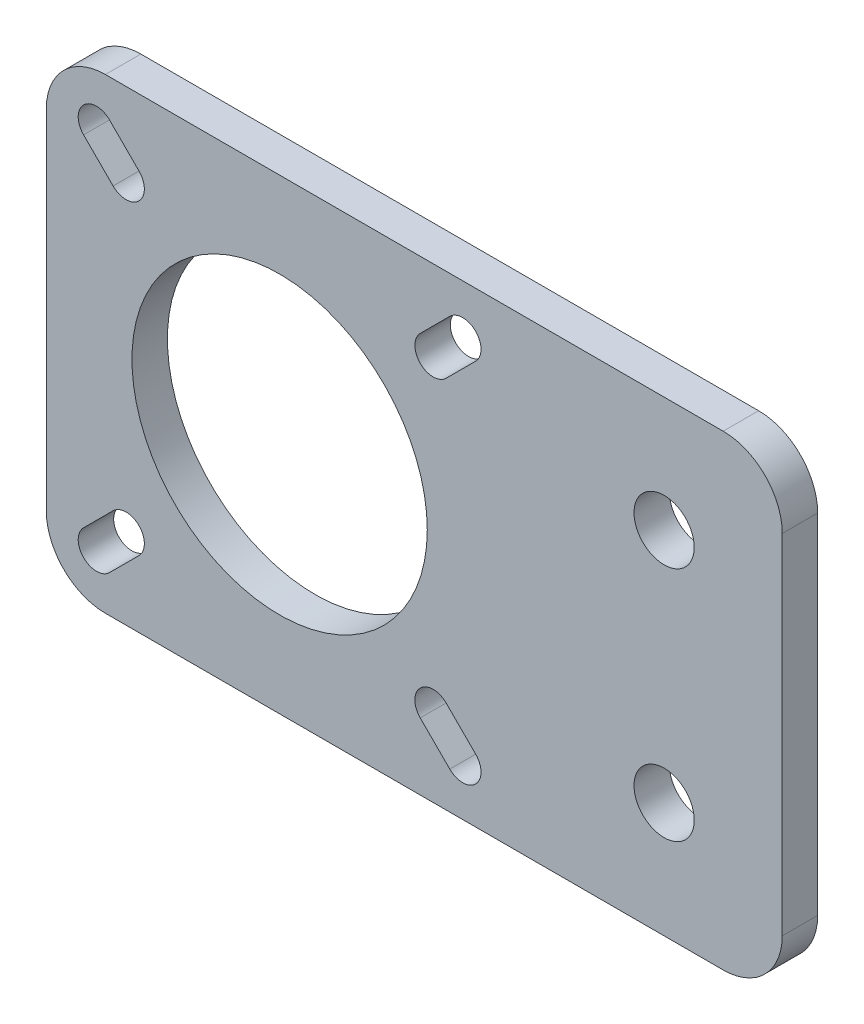
ISO-10303-21;
HEADER;
FILE_DESCRIPTION(('STEP AP214'),'2;1');
FILE_NAME('part.step','',(''),(''),'','','');
FILE_SCHEMA(('AUTOMOTIVE_DESIGN { 1 0 10303 214 1 1 1 1 }'));
ENDSEC;
DATA;
#1=APPLICATION_CONTEXT('core data for automotive mechanical design processes');
#2=APPLICATION_PROTOCOL_DEFINITION('international standard','automotive_design',2000,#1);
#3=PRODUCT_CONTEXT('',#1,'mechanical');
#4=PRODUCT('Part','Part','',(#3));
#5=PRODUCT_RELATED_PRODUCT_CATEGORY('part','',(#4));
#6=PRODUCT_DEFINITION_FORMATION('','',#4);
#7=PRODUCT_DEFINITION_CONTEXT('part definition',#1,'design');
#8=PRODUCT_DEFINITION('design','',#6,#7);
#9=PRODUCT_DEFINITION_SHAPE('','',#8);
#10=(LENGTH_UNIT() NAMED_UNIT(*) SI_UNIT(.MILLI.,.METRE.));
#11=(NAMED_UNIT(*) PLANE_ANGLE_UNIT() SI_UNIT($,.RADIAN.));
#12=(NAMED_UNIT(*) SI_UNIT($,.STERADIAN.) SOLID_ANGLE_UNIT());
#13=UNCERTAINTY_MEASURE_WITH_UNIT(LENGTH_MEASURE(1.E-05),#10,'distance_accuracy_value','');
#14=(GEOMETRIC_REPRESENTATION_CONTEXT(3) GLOBAL_UNCERTAINTY_ASSIGNED_CONTEXT((#13)) GLOBAL_UNIT_ASSIGNED_CONTEXT((#10,
#11,#12)) REPRESENTATION_CONTEXT('',''));
#15=CARTESIAN_POINT('',(0.,0.,0.));
#16=DIRECTION('',(0.,0.,1.));
#17=DIRECTION('',(1.,0.,0.));
#18=AXIS2_PLACEMENT_3D('',#15,#16,#17);
#19=CARTESIAN_POINT('',(0.,0.,3.));
#20=DIRECTION('',(0.,0.,-1.));
#21=DIRECTION('',(-1.,0.,0.));
#22=AXIS2_PLACEMENT_3D('',#19,#20,#21);
#23=PLANE('',#22);
#24=CARTESIAN_POINT('',(35.2499999999996,4.25,3.));
#25=DIRECTION('',(0.,0.,1.));
#26=DIRECTION('',(1.,0.,0.));
#27=AXIS2_PLACEMENT_3D('',#24,#25,#26);
#28=CIRCLE('',#27,1.55);
#29=CARTESIAN_POINT('',(34.1539844891605,3.15398448916086,3.));
#30=VERTEX_POINT('',#29);
#31=CARTESIAN_POINT('',(36.3460155108388,5.34601551083915,3.));
#32=VERTEX_POINT('',#31);
#33=EDGE_CURVE('E240',#30,#32,#28,.T.);
#34=ORIENTED_EDGE('',*,*,#33,.F.);
#35=DIRECTION('',(0.707106781186543,-0.707106781186552,0.));
#36=VECTOR('',#35,1.);
#37=CARTESIAN_POINT('',(34.1539844891605,3.15398448916086,3.));
#38=LINE('',#37,#36);
#39=CARTESIAN_POINT('',(31.6539844891605,5.65398448916084,3.));
#40=VERTEX_POINT('',#39);
#41=EDGE_CURVE('E248',#40,#30,#38,.T.);
#42=ORIENTED_EDGE('',*,*,#41,.F.);
#43=CARTESIAN_POINT('',(32.7499999999997,6.74999999999999,3.));
#44=DIRECTION('',(0.,0.,1.));
#45=DIRECTION('',(1.,0.,0.));
#46=AXIS2_PLACEMENT_3D('',#43,#44,#45);
#47=CIRCLE('',#46,1.55);
#48=CARTESIAN_POINT('',(33.8460155108388,7.84601551083913,3.));
#49=VERTEX_POINT('',#48);
#50=EDGE_CURVE('E245',#49,#40,#47,.T.);
#51=ORIENTED_EDGE('',*,*,#50,.F.);
#52=DIRECTION('',(-0.707106781186543,0.707106781186552,0.));
#53=VECTOR('',#52,1.);
#54=CARTESIAN_POINT('',(36.3460155108388,5.34601551083915,3.));
#55=LINE('',#54,#53);
#56=EDGE_CURVE('E242',#32,#49,#55,.T.);
#57=ORIENTED_EDGE('',*,*,#56,.F.);
#58=EDGE_LOOP('',(#34,#42,#51,#57));
#59=FACE_BOUND('',#58,.T.);
#60=CARTESIAN_POINT('',(4.24999999999997,35.25,3.));
#61=DIRECTION('',(0.,0.,1.));
#62=DIRECTION('',(1.,0.,0.));
#63=AXIS2_PLACEMENT_3D('',#60,#61,#62);
#64=CIRCLE('',#63,1.55);
#65=CARTESIAN_POINT('',(5.34601551083912,36.3460155108391,3.));
#66=VERTEX_POINT('',#65);
#67=CARTESIAN_POINT('',(3.15398448916081,34.1539844891608,3.));
#68=VERTEX_POINT('',#67);
#69=EDGE_CURVE('E302',#66,#68,#64,.T.);
#70=ORIENTED_EDGE('',*,*,#69,.F.);
#71=DIRECTION('',(-0.707106781186544,0.707106781186551,0.));
#72=VECTOR('',#71,1.);
#73=CARTESIAN_POINT('',(5.34601551083912,36.3460155108391,3.));
#74=LINE('',#73,#72);
#75=CARTESIAN_POINT('',(7.84601551083908,33.8460155108392,3.));
#76=VERTEX_POINT('',#75);
#77=EDGE_CURVE('E310',#76,#66,#74,.T.);
#78=ORIENTED_EDGE('',*,*,#77,.F.);
#79=CARTESIAN_POINT('',(6.74999999999993,32.75,3.));
#80=DIRECTION('',(0.,0.,1.));
#81=DIRECTION('',(1.,0.,0.));
#82=AXIS2_PLACEMENT_3D('',#79,#80,#81);
#83=CIRCLE('',#82,1.55);
#84=CARTESIAN_POINT('',(5.65398448916077,31.6539844891609,3.));
#85=VERTEX_POINT('',#84);
#86=EDGE_CURVE('E307',#85,#76,#83,.T.);
#87=ORIENTED_EDGE('',*,*,#86,.F.);
#88=DIRECTION('',(0.707106781186543,-0.707106781186552,0.));
#89=VECTOR('',#88,1.);
#90=CARTESIAN_POINT('',(3.15398448916081,34.1539844891608,3.));
#91=LINE('',#90,#89);
#92=EDGE_CURVE('E304',#68,#85,#91,.T.);
#93=ORIENTED_EDGE('',*,*,#92,.F.);
#94=EDGE_LOOP('',(#70,#78,#87,#93));
#95=FACE_BOUND('',#94,.T.);
#96=DIRECTION('',(0.,-1.,0.));
#97=VECTOR('',#96,1.);
#98=CARTESIAN_POINT('',(0.,0.,3.));
#99=LINE('',#98,#97);
#100=CARTESIAN_POINT('',(0.,34.5,3.));
#101=VERTEX_POINT('',#100);
#102=CARTESIAN_POINT('',(0.,5.,3.));
#103=VERTEX_POINT('',#102);
#104=EDGE_CURVE('E339',#101,#103,#99,.T.);
#105=ORIENTED_EDGE('',*,*,#104,.T.);
#106=CARTESIAN_POINT('',(5.,5.,3.));
#107=DIRECTION('',(0.,0.,-1.));
#108=DIRECTION('',(-1.,0.,0.));
#109=AXIS2_PLACEMENT_3D('',#106,#107,#108);
#110=CIRCLE('',#109,5.);
#111=CARTESIAN_POINT('',(5.,0.,3.));
#112=VERTEX_POINT('',#111);
#113=EDGE_CURVE('E382',#103,#112,#110,.F.);
#114=ORIENTED_EDGE('',*,*,#113,.T.);
#115=DIRECTION('',(1.,0.,0.));
#116=VECTOR('',#115,1.);
#117=CARTESIAN_POINT('',(0.,0.,3.));
#118=LINE('',#117,#116);
#119=CARTESIAN_POINT('',(57.2999999999998,0.,3.));
#120=VERTEX_POINT('',#119);
#121=EDGE_CURVE('E342',#112,#120,#118,.T.);
#122=ORIENTED_EDGE('',*,*,#121,.T.);
#123=CARTESIAN_POINT('',(57.2999999999998,5.,3.));
#124=DIRECTION('',(0.,0.,-1.));
#125=DIRECTION('',(-1.,0.,0.));
#126=AXIS2_PLACEMENT_3D('',#123,#124,#125);
#127=CIRCLE('',#126,5.);
#128=CARTESIAN_POINT('',(62.2999999999998,5.,3.));
#129=VERTEX_POINT('',#128);
#130=EDGE_CURVE('E380',#120,#129,#127,.F.);
#131=ORIENTED_EDGE('',*,*,#130,.T.);
#132=DIRECTION('',(0.,1.,0.));
#133=VECTOR('',#132,1.);
#134=CARTESIAN_POINT('',(62.2999999999998,39.5,3.));
#135=LINE('',#134,#133);
#136=CARTESIAN_POINT('',(62.2999999999998,34.5,3.));
#137=VERTEX_POINT('',#136);
#138=EDGE_CURVE('E346',#129,#137,#135,.T.);
#139=ORIENTED_EDGE('',*,*,#138,.T.);
#140=CARTESIAN_POINT('',(57.2999999999998,34.5,3.));
#141=DIRECTION('',(0.,0.,-1.));
#142=DIRECTION('',(-1.,0.,0.));
#143=AXIS2_PLACEMENT_3D('',#140,#141,#142);
#144=CIRCLE('',#143,5.);
#145=CARTESIAN_POINT('',(57.2999999999998,39.5,3.));
#146=VERTEX_POINT('',#145);
#147=EDGE_CURVE('E54',#137,#146,#144,.F.);
#148=ORIENTED_EDGE('',*,*,#147,.T.);
#149=DIRECTION('',(-1.,0.,0.));
#150=VECTOR('',#149,1.);
#151=CARTESIAN_POINT('',(0.,39.5,3.));
#152=LINE('',#151,#150);
#153=CARTESIAN_POINT('',(5.,39.5,3.));
#154=VERTEX_POINT('',#153);
#155=EDGE_CURVE('E348',#146,#154,#152,.T.);
#156=ORIENTED_EDGE('',*,*,#155,.T.);
#157=CARTESIAN_POINT('',(5.,34.5,3.));
#158=DIRECTION('',(0.,0.,-1.));
#159=DIRECTION('',(-1.,0.,0.));
#160=AXIS2_PLACEMENT_3D('',#157,#158,#159);
#161=CIRCLE('',#160,5.);
#162=EDGE_CURVE('E377',#154,#101,#161,.F.);
#163=ORIENTED_EDGE('',*,*,#162,.T.);
#164=EDGE_LOOP('',(#105,#114,#122,#131,#139,#148,#156,#163));
#165=FACE_BOUND('',#164,.T.);
#166=CARTESIAN_POINT('',(19.7499999999998,19.75,3.));
#167=DIRECTION('',(0.,0.,1.));
#168=DIRECTION('',(1.,0.,0.));
#169=AXIS2_PLACEMENT_3D('',#166,#167,#168);
#170=CIRCLE('',#169,12.5);
#171=CARTESIAN_POINT('',(32.2499999999998,19.75,3.));
#172=VERTEX_POINT('',#171);
#173=EDGE_CURVE('E333',#172,#172,#170,.T.);
#174=ORIENTED_EDGE('',*,*,#173,.F.);
#175=EDGE_LOOP('',(#174));
#176=FACE_BOUND('',#175,.T.);
#177=CARTESIAN_POINT('',(35.2499999999996,35.25,3.));
#178=DIRECTION('',(0.,0.,1.));
#179=DIRECTION('',(-1.,0.,0.));
#180=AXIS2_PLACEMENT_3D('',#177,#178,#179);
#181=CIRCLE('',#180,1.55);
#182=CARTESIAN_POINT('',(36.3460155108388,34.1539844891608,3.));
#183=VERTEX_POINT('',#182);
#184=CARTESIAN_POINT('',(34.1539844891605,36.3460155108391,3.));
#185=VERTEX_POINT('',#184);
#186=EDGE_CURVE('E271',#183,#185,#181,.T.);
#187=ORIENTED_EDGE('',*,*,#186,.F.);
#188=DIRECTION('',(0.707106781186542,0.707106781186553,0.));
#189=VECTOR('',#188,1.);
#190=CARTESIAN_POINT('',(36.3460155108388,34.1539844891608,3.));
#191=LINE('',#190,#189);
#192=CARTESIAN_POINT('',(33.8460155108388,31.6539844891609,3.));
#193=VERTEX_POINT('',#192);
#194=EDGE_CURVE('E279',#193,#183,#191,.T.);
#195=ORIENTED_EDGE('',*,*,#194,.F.);
#196=CARTESIAN_POINT('',(32.7499999999997,32.75,3.));
#197=DIRECTION('',(0.,0.,1.));
#198=DIRECTION('',(-1.,0.,0.));
#199=AXIS2_PLACEMENT_3D('',#196,#197,#198);
#200=CIRCLE('',#199,1.55);
#201=CARTESIAN_POINT('',(31.6539844891605,33.8460155108392,3.));
#202=VERTEX_POINT('',#201);
#203=EDGE_CURVE('E276',#202,#193,#200,.T.);
#204=ORIENTED_EDGE('',*,*,#203,.F.);
#205=DIRECTION('',(-0.707106781186542,-0.707106781186553,0.));
#206=VECTOR('',#205,1.);
#207=CARTESIAN_POINT('',(34.1539844891605,36.3460155108391,3.));
#208=LINE('',#207,#206);
#209=EDGE_CURVE('E273',#185,#202,#208,.T.);
#210=ORIENTED_EDGE('',*,*,#209,.F.);
#211=EDGE_LOOP('',(#187,#195,#204,#210));
#212=FACE_BOUND('',#211,.T.);
#213=CARTESIAN_POINT('',(4.24999999999997,4.25,3.));
#214=DIRECTION('',(0.,0.,1.));
#215=DIRECTION('',(-1.,0.,0.));
#216=AXIS2_PLACEMENT_3D('',#213,#214,#215);
#217=CIRCLE('',#216,1.55);
#218=CARTESIAN_POINT('',(3.15398448916081,5.34601551083915,3.));
#219=VERTEX_POINT('',#218);
#220=CARTESIAN_POINT('',(5.34601551083912,3.15398448916086,3.));
#221=VERTEX_POINT('',#220);
#222=EDGE_CURVE('E196',#219,#221,#217,.T.);
#223=ORIENTED_EDGE('',*,*,#222,.F.);
#224=DIRECTION('',(-0.707106781186543,-0.707106781186552,0.));
#225=VECTOR('',#224,1.);
#226=CARTESIAN_POINT('',(3.15398448916081,5.34601551083915,3.));
#227=LINE('',#226,#225);
#228=CARTESIAN_POINT('',(5.65398448916076,7.84601551083913,3.));
#229=VERTEX_POINT('',#228);
#230=EDGE_CURVE('E222',#229,#219,#227,.T.);
#231=ORIENTED_EDGE('',*,*,#230,.F.);
#232=CARTESIAN_POINT('',(6.74999999999992,6.75,3.));
#233=DIRECTION('',(0.,0.,1.));
#234=DIRECTION('',(-1.,0.,0.));
#235=AXIS2_PLACEMENT_3D('',#232,#233,#234);
#236=CIRCLE('',#235,1.55);
#237=CARTESIAN_POINT('',(7.84601551083908,5.65398448916085,3.));
#238=VERTEX_POINT('',#237);
#239=EDGE_CURVE('E220',#238,#229,#236,.T.);
#240=ORIENTED_EDGE('',*,*,#239,.F.);
#241=DIRECTION('',(0.707106781186544,0.707106781186551,0.));
#242=VECTOR('',#241,1.);
#243=CARTESIAN_POINT('',(5.34601551083912,3.15398448916086,3.));
#244=LINE('',#243,#242);
#245=EDGE_CURVE('E206',#221,#238,#244,.T.);
#246=ORIENTED_EDGE('',*,*,#245,.F.);
#247=EDGE_LOOP('',(#223,#231,#240,#246));
#248=FACE_BOUND('',#247,.T.);
#249=CARTESIAN_POINT('',(52.2999999999998,29.75,3.));
#250=DIRECTION('',(0.,0.,1.));
#251=DIRECTION('',(1.,0.,0.));
#252=AXIS2_PLACEMENT_3D('',#249,#250,#251);
#253=CIRCLE('',#252,2.55);
#254=CARTESIAN_POINT('',(54.8499999999998,29.75,3.));
#255=VERTEX_POINT('',#254);
#256=EDGE_CURVE('E229',#255,#255,#253,.T.);
#257=ORIENTED_EDGE('',*,*,#256,.F.);
#258=EDGE_LOOP('',(#257));
#259=FACE_BOUND('',#258,.T.);
#260=CARTESIAN_POINT('',(52.2999999999998,9.75,3.));
#261=DIRECTION('',(0.,0.,1.));
#262=DIRECTION('',(1.,0.,0.));
#263=AXIS2_PLACEMENT_3D('',#260,#261,#262);
#264=CIRCLE('',#263,2.55);
#265=CARTESIAN_POINT('',(54.8499999999998,9.75,3.));
#266=VERTEX_POINT('',#265);
#267=EDGE_CURVE('E694',#266,#266,#264,.T.);
#268=ORIENTED_EDGE('',*,*,#267,.F.);
#269=EDGE_LOOP('',(#268));
#270=FACE_BOUND('',#269,.T.);
#271=ADVANCED_FACE('F33',(#59,#95,#165,#176,#212,#248,#259,#270),#23,.F.);
#272=CARTESIAN_POINT('',(0.,0.,0.));
#273=DIRECTION('',(0.,0.,-1.));
#274=DIRECTION('',(-1.,0.,0.));
#275=AXIS2_PLACEMENT_3D('',#272,#273,#274);
#276=PLANE('',#275);
#277=CARTESIAN_POINT('',(52.2999999999998,29.75,0.));
#278=DIRECTION('',(0.,0.,1.));
#279=DIRECTION('',(1.,0.,0.));
#280=AXIS2_PLACEMENT_3D('',#277,#278,#279);
#281=CIRCLE('',#280,2.55);
#282=CARTESIAN_POINT('',(54.8499999999998,29.75,0.));
#283=VERTEX_POINT('',#282);
#284=EDGE_CURVE('E700',#283,#283,#281,.T.);
#285=ORIENTED_EDGE('',*,*,#284,.T.);
#286=EDGE_LOOP('',(#285));
#287=FACE_BOUND('',#286,.T.);
#288=DIRECTION('',(1.,0.,0.));
#289=VECTOR('',#288,1.);
#290=CARTESIAN_POINT('',(0.,0.,0.));
#291=LINE('',#290,#289);
#292=CARTESIAN_POINT('',(5.,0.,0.));
#293=VERTEX_POINT('',#292);
#294=CARTESIAN_POINT('',(57.2999999999998,0.,0.));
#295=VERTEX_POINT('',#294);
#296=EDGE_CURVE('E353',#293,#295,#291,.T.);
#297=ORIENTED_EDGE('',*,*,#296,.F.);
#298=CARTESIAN_POINT('',(5.,5.,0.));
#299=DIRECTION('',(0.,0.,-1.));
#300=DIRECTION('',(-1.,0.,0.));
#301=AXIS2_PLACEMENT_3D('',#298,#299,#300);
#302=CIRCLE('',#301,5.);
#303=CARTESIAN_POINT('',(0.,5.,0.));
#304=VERTEX_POINT('',#303);
#305=EDGE_CURVE('E370',#293,#304,#302,.T.);
#306=ORIENTED_EDGE('',*,*,#305,.T.);
#307=DIRECTION('',(0.,-1.,0.));
#308=VECTOR('',#307,1.);
#309=CARTESIAN_POINT('',(0.,0.,0.));
#310=LINE('',#309,#308);
#311=CARTESIAN_POINT('',(0.,34.5,0.));
#312=VERTEX_POINT('',#311);
#313=EDGE_CURVE('E336',#312,#304,#310,.T.);
#314=ORIENTED_EDGE('',*,*,#313,.F.);
#315=CARTESIAN_POINT('',(5.,34.5,0.));
#316=DIRECTION('',(0.,0.,-1.));
#317=DIRECTION('',(-1.,0.,0.));
#318=AXIS2_PLACEMENT_3D('',#315,#316,#317);
#319=CIRCLE('',#318,5.);
#320=CARTESIAN_POINT('',(5.,39.5,0.));
#321=VERTEX_POINT('',#320);
#322=EDGE_CURVE('E364',#312,#321,#319,.T.);
#323=ORIENTED_EDGE('',*,*,#322,.T.);
#324=DIRECTION('',(-1.,0.,0.));
#325=VECTOR('',#324,1.);
#326=CARTESIAN_POINT('',(0.,39.5,0.));
#327=LINE('',#326,#325);
#328=CARTESIAN_POINT('',(57.2999999999998,39.5,0.));
#329=VERTEX_POINT('',#328);
#330=EDGE_CURVE('E343',#329,#321,#327,.T.);
#331=ORIENTED_EDGE('',*,*,#330,.F.);
#332=CARTESIAN_POINT('',(57.2999999999998,34.5,0.));
#333=DIRECTION('',(0.,0.,-1.));
#334=DIRECTION('',(-1.,0.,0.));
#335=AXIS2_PLACEMENT_3D('',#332,#333,#334);
#336=CIRCLE('',#335,5.);
#337=CARTESIAN_POINT('',(62.2999999999998,34.5,0.));
#338=VERTEX_POINT('',#337);
#339=EDGE_CURVE('E366',#329,#338,#336,.T.);
#340=ORIENTED_EDGE('',*,*,#339,.T.);
#341=DIRECTION('',(0.,1.,0.));
#342=VECTOR('',#341,1.);
#343=CARTESIAN_POINT('',(62.2999999999998,39.5,0.));
#344=LINE('',#343,#342);
#345=CARTESIAN_POINT('',(62.2999999999998,5.,0.));
#346=VERTEX_POINT('',#345);
#347=EDGE_CURVE('E356',#346,#338,#344,.T.);
#348=ORIENTED_EDGE('',*,*,#347,.F.);
#349=CARTESIAN_POINT('',(57.2999999999998,5.,0.));
#350=DIRECTION('',(0.,0.,-1.));
#351=DIRECTION('',(-1.,0.,0.));
#352=AXIS2_PLACEMENT_3D('',#349,#350,#351);
#353=CIRCLE('',#352,5.);
#354=EDGE_CURVE('E368',#346,#295,#353,.T.);
#355=ORIENTED_EDGE('',*,*,#354,.T.);
#356=EDGE_LOOP('',(#297,#306,#314,#323,#331,#340,#348,#355));
#357=FACE_BOUND('',#356,.T.);
#358=CARTESIAN_POINT('',(19.7499999999998,19.75,0.));
#359=DIRECTION('',(0.,0.,1.));
#360=DIRECTION('',(1.,0.,0.));
#361=AXIS2_PLACEMENT_3D('',#358,#359,#360);
#362=CIRCLE('',#361,12.5);
#363=CARTESIAN_POINT('',(32.2499999999998,19.75,0.));
#364=VERTEX_POINT('',#363);
#365=EDGE_CURVE('E332',#364,#364,#362,.T.);
#366=ORIENTED_EDGE('',*,*,#365,.T.);
#367=EDGE_LOOP('',(#366));
#368=FACE_BOUND('',#367,.T.);
#369=DIRECTION('',(-0.707106781186544,0.707106781186551,0.));
#370=VECTOR('',#369,1.);
#371=CARTESIAN_POINT('',(5.34601551083912,36.3460155108391,0.));
#372=LINE('',#371,#370);
#373=CARTESIAN_POINT('',(7.84601551083908,33.8460155108392,0.));
#374=VERTEX_POINT('',#373);
#375=CARTESIAN_POINT('',(5.34601551083912,36.3460155108391,0.));
#376=VERTEX_POINT('',#375);
#377=EDGE_CURVE('E305',#374,#376,#372,.T.);
#378=ORIENTED_EDGE('',*,*,#377,.T.);
#379=CARTESIAN_POINT('',(4.24999999999997,35.25,0.));
#380=DIRECTION('',(0.,0.,1.));
#381=DIRECTION('',(1.,0.,0.));
#382=AXIS2_PLACEMENT_3D('',#379,#380,#381);
#383=CIRCLE('',#382,1.55);
#384=CARTESIAN_POINT('',(3.15398448916081,34.1539844891608,0.));
#385=VERTEX_POINT('',#384);
#386=EDGE_CURVE('E301',#376,#385,#383,.T.);
#387=ORIENTED_EDGE('',*,*,#386,.T.);
#388=DIRECTION('',(0.707106781186543,-0.707106781186552,0.));
#389=VECTOR('',#388,1.);
#390=CARTESIAN_POINT('',(3.15398448916081,34.1539844891608,0.));
#391=LINE('',#390,#389);
#392=CARTESIAN_POINT('',(5.65398448916077,31.6539844891609,0.));
#393=VERTEX_POINT('',#392);
#394=EDGE_CURVE('E315',#385,#393,#391,.T.);
#395=ORIENTED_EDGE('',*,*,#394,.T.);
#396=CARTESIAN_POINT('',(6.74999999999993,32.75,0.));
#397=DIRECTION('',(0.,0.,1.));
#398=DIRECTION('',(1.,0.,0.));
#399=AXIS2_PLACEMENT_3D('',#396,#397,#398);
#400=CIRCLE('',#399,1.55);
#401=EDGE_CURVE('E318',#393,#374,#400,.T.);
#402=ORIENTED_EDGE('',*,*,#401,.T.);
#403=EDGE_LOOP('',(#378,#387,#395,#402));
#404=FACE_BOUND('',#403,.T.);
#405=DIRECTION('',(0.707106781186542,0.707106781186553,0.));
#406=VECTOR('',#405,1.);
#407=CARTESIAN_POINT('',(36.3460155108388,34.1539844891608,0.));
#408=LINE('',#407,#406);
#409=CARTESIAN_POINT('',(33.8460155108388,31.6539844891609,0.));
#410=VERTEX_POINT('',#409);
#411=CARTESIAN_POINT('',(36.3460155108388,34.1539844891608,0.));
#412=VERTEX_POINT('',#411);
#413=EDGE_CURVE('E274',#410,#412,#408,.T.);
#414=ORIENTED_EDGE('',*,*,#413,.T.);
#415=CARTESIAN_POINT('',(35.2499999999996,35.25,0.));
#416=DIRECTION('',(0.,0.,1.));
#417=DIRECTION('',(-1.,0.,0.));
#418=AXIS2_PLACEMENT_3D('',#415,#416,#417);
#419=CIRCLE('',#418,1.55);
#420=CARTESIAN_POINT('',(34.1539844891605,36.3460155108391,0.));
#421=VERTEX_POINT('',#420);
#422=EDGE_CURVE('E270',#412,#421,#419,.T.);
#423=ORIENTED_EDGE('',*,*,#422,.T.);
#424=DIRECTION('',(-0.707106781186542,-0.707106781186553,0.));
#425=VECTOR('',#424,1.);
#426=CARTESIAN_POINT('',(34.1539844891605,36.3460155108391,0.));
#427=LINE('',#426,#425);
#428=CARTESIAN_POINT('',(31.6539844891605,33.8460155108392,0.));
#429=VERTEX_POINT('',#428);
#430=EDGE_CURVE('E284',#421,#429,#427,.T.);
#431=ORIENTED_EDGE('',*,*,#430,.T.);
#432=CARTESIAN_POINT('',(32.7499999999997,32.75,0.));
#433=DIRECTION('',(0.,0.,1.));
#434=DIRECTION('',(-1.,0.,0.));
#435=AXIS2_PLACEMENT_3D('',#432,#433,#434);
#436=CIRCLE('',#435,1.55);
#437=EDGE_CURVE('E287',#429,#410,#436,.T.);
#438=ORIENTED_EDGE('',*,*,#437,.T.);
#439=EDGE_LOOP('',(#414,#423,#431,#438));
#440=FACE_BOUND('',#439,.T.);
#441=DIRECTION('',(0.707106781186543,-0.707106781186552,0.));
#442=VECTOR('',#441,1.);
#443=CARTESIAN_POINT('',(34.1539844891605,3.15398448916086,0.));
#444=LINE('',#443,#442);
#445=CARTESIAN_POINT('',(31.6539844891605,5.65398448916084,0.));
#446=VERTEX_POINT('',#445);
#447=CARTESIAN_POINT('',(34.1539844891605,3.15398448916087,0.));
#448=VERTEX_POINT('',#447);
#449=EDGE_CURVE('E243',#446,#448,#444,.T.);
#450=ORIENTED_EDGE('',*,*,#449,.T.);
#451=CARTESIAN_POINT('',(35.2499999999996,4.25,0.));
#452=DIRECTION('',(0.,0.,1.));
#453=DIRECTION('',(1.,0.,0.));
#454=AXIS2_PLACEMENT_3D('',#451,#452,#453);
#455=CIRCLE('',#454,1.55);
#456=CARTESIAN_POINT('',(36.3460155108388,5.34601551083915,0.));
#457=VERTEX_POINT('',#456);
#458=EDGE_CURVE('E214',#448,#457,#455,.T.);
#459=ORIENTED_EDGE('',*,*,#458,.T.);
#460=DIRECTION('',(-0.707106781186543,0.707106781186552,0.));
#461=VECTOR('',#460,1.);
#462=CARTESIAN_POINT('',(36.3460155108388,5.34601551083915,0.));
#463=LINE('',#462,#461);
#464=CARTESIAN_POINT('',(33.8460155108388,7.84601551083913,0.));
#465=VERTEX_POINT('',#464);
#466=EDGE_CURVE('E253',#457,#465,#463,.T.);
#467=ORIENTED_EDGE('',*,*,#466,.T.);
#468=CARTESIAN_POINT('',(32.7499999999997,6.74999999999999,0.));
#469=DIRECTION('',(0.,0.,1.));
#470=DIRECTION('',(1.,0.,0.));
#471=AXIS2_PLACEMENT_3D('',#468,#469,#470);
#472=CIRCLE('',#471,1.55);
#473=EDGE_CURVE('E256',#465,#446,#472,.T.);
#474=ORIENTED_EDGE('',*,*,#473,.T.);
#475=EDGE_LOOP('',(#450,#459,#467,#474));
#476=FACE_BOUND('',#475,.T.);
#477=DIRECTION('',(-0.707106781186543,-0.707106781186552,0.));
#478=VECTOR('',#477,1.);
#479=CARTESIAN_POINT('',(3.15398448916081,5.34601551083915,0.));
#480=LINE('',#479,#478);
#481=CARTESIAN_POINT('',(5.65398448916076,7.84601551083914,0.));
#482=VERTEX_POINT('',#481);
#483=CARTESIAN_POINT('',(3.15398448916081,5.34601551083915,0.));
#484=VERTEX_POINT('',#483);
#485=EDGE_CURVE('E207',#482,#484,#480,.T.);
#486=ORIENTED_EDGE('',*,*,#485,.T.);
#487=CARTESIAN_POINT('',(4.24999999999997,4.25,0.));
#488=DIRECTION('',(0.,0.,1.));
#489=DIRECTION('',(-1.,0.,0.));
#490=AXIS2_PLACEMENT_3D('',#487,#488,#489);
#491=CIRCLE('',#490,1.55);
#492=CARTESIAN_POINT('',(5.34601551083912,3.15398448916086,0.));
#493=VERTEX_POINT('',#492);
#494=EDGE_CURVE('E227',#484,#493,#491,.T.);
#495=ORIENTED_EDGE('',*,*,#494,.T.);
#496=DIRECTION('',(0.707106781186544,0.707106781186551,0.));
#497=VECTOR('',#496,1.);
#498=CARTESIAN_POINT('',(5.34601551083912,3.15398448916086,0.));
#499=LINE('',#498,#497);
#500=CARTESIAN_POINT('',(7.84601551083908,5.65398448916085,0.));
#501=VERTEX_POINT('',#500);
#502=EDGE_CURVE('E213',#493,#501,#499,.T.);
#503=ORIENTED_EDGE('',*,*,#502,.T.);
#504=CARTESIAN_POINT('',(6.74999999999992,6.75,0.));
#505=DIRECTION('',(0.,0.,1.));
#506=DIRECTION('',(-1.,0.,0.));
#507=AXIS2_PLACEMENT_3D('',#504,#505,#506);
#508=CIRCLE('',#507,1.55);
#509=EDGE_CURVE('E231',#501,#482,#508,.T.);
#510=ORIENTED_EDGE('',*,*,#509,.T.);
#511=EDGE_LOOP('',(#486,#495,#503,#510));
#512=FACE_BOUND('',#511,.T.);
#513=CARTESIAN_POINT('',(52.2999999999998,9.75,0.));
#514=DIRECTION('',(0.,0.,1.));
#515=DIRECTION('',(1.,0.,0.));
#516=AXIS2_PLACEMENT_3D('',#513,#514,#515);
#517=CIRCLE('',#516,2.55);
#518=CARTESIAN_POINT('',(54.8499999999998,9.75,0.));
#519=VERTEX_POINT('',#518);
#520=EDGE_CURVE('E697',#519,#519,#517,.T.);
#521=ORIENTED_EDGE('',*,*,#520,.T.);
#522=EDGE_LOOP('',(#521));
#523=FACE_BOUND('',#522,.T.);
#524=ADVANCED_FACE('F398',(#287,#357,#368,#404,#440,#476,#512,#523),#276,.T.);
#525=CARTESIAN_POINT('',(0.,0.,3.));
#526=DIRECTION('',(1.,0.,0.));
#527=DIRECTION('',(0.,0.,-1.));
#528=AXIS2_PLACEMENT_3D('',#525,#526,#527);
#529=PLANE('',#528);
#530=ORIENTED_EDGE('',*,*,#313,.T.);
#531=DIRECTION('',(0.,0.,-1.));
#532=VECTOR('',#531,1.);
#533=CARTESIAN_POINT('',(0.,5.,3.));
#534=LINE('',#533,#532);
#535=EDGE_CURVE('E375',#304,#103,#534,.F.);
#536=ORIENTED_EDGE('',*,*,#535,.T.);
#537=ORIENTED_EDGE('',*,*,#104,.F.);
#538=DIRECTION('',(0.,0.,-1.));
#539=VECTOR('',#538,1.);
#540=CARTESIAN_POINT('',(0.,34.5,3.));
#541=LINE('',#540,#539);
#542=EDGE_CURVE('E372',#101,#312,#541,.T.);
#543=ORIENTED_EDGE('',*,*,#542,.T.);
#544=EDGE_LOOP('',(#530,#536,#537,#543));
#545=FACE_BOUND('',#544,.T.);
#546=ADVANCED_FACE('F412',(#545),#529,.F.);
#547=CARTESIAN_POINT('',(0.,0.,3.));
#548=DIRECTION('',(0.,1.,0.));
#549=DIRECTION('',(0.,0.,1.));
#550=AXIS2_PLACEMENT_3D('',#547,#548,#549);
#551=PLANE('',#550);
#552=ORIENTED_EDGE('',*,*,#121,.F.);
#553=DIRECTION('',(0.,0.,-1.));
#554=VECTOR('',#553,1.);
#555=CARTESIAN_POINT('',(5.,0.,3.));
#556=LINE('',#555,#554);
#557=EDGE_CURVE('E361',#112,#293,#556,.T.);
#558=ORIENTED_EDGE('',*,*,#557,.T.);
#559=ORIENTED_EDGE('',*,*,#296,.T.);
#560=DIRECTION('',(0.,0.,-1.));
#561=VECTOR('',#560,1.);
#562=CARTESIAN_POINT('',(57.2999999999998,0.,3.));
#563=LINE('',#562,#561);
#564=EDGE_CURVE('E350',#295,#120,#563,.F.);
#565=ORIENTED_EDGE('',*,*,#564,.T.);
#566=EDGE_LOOP('',(#552,#558,#559,#565));
#567=FACE_BOUND('',#566,.T.);
#568=ADVANCED_FACE('F420',(#567),#551,.F.);
#569=CARTESIAN_POINT('',(62.2999999999998,39.5,3.));
#570=DIRECTION('',(-1.,0.,0.));
#571=DIRECTION('',(0.,0.,1.));
#572=AXIS2_PLACEMENT_3D('',#569,#570,#571);
#573=PLANE('',#572);
#574=ORIENTED_EDGE('',*,*,#138,.F.);
#575=DIRECTION('',(0.,0.,-1.));
#576=VECTOR('',#575,1.);
#577=CARTESIAN_POINT('',(62.2999999999998,5.,3.));
#578=LINE('',#577,#576);
#579=EDGE_CURVE('E386',#129,#346,#578,.T.);
#580=ORIENTED_EDGE('',*,*,#579,.T.);
#581=ORIENTED_EDGE('',*,*,#347,.T.);
#582=DIRECTION('',(0.,0.,-1.));
#583=VECTOR('',#582,1.);
#584=CARTESIAN_POINT('',(62.2999999999998,34.5,3.));
#585=LINE('',#584,#583);
#586=EDGE_CURVE('E384',#338,#137,#585,.F.);
#587=ORIENTED_EDGE('',*,*,#586,.T.);
#588=EDGE_LOOP('',(#574,#580,#581,#587));
#589=FACE_BOUND('',#588,.T.);
#590=ADVANCED_FACE('F392',(#589),#573,.F.);
#591=CARTESIAN_POINT('',(0.,39.5,3.));
#592=DIRECTION('',(0.,-1.,0.));
#593=DIRECTION('',(0.,0.,-1.));
#594=AXIS2_PLACEMENT_3D('',#591,#592,#593);
#595=PLANE('',#594);
#596=ORIENTED_EDGE('',*,*,#155,.F.);
#597=DIRECTION('',(0.,0.,-1.));
#598=VECTOR('',#597,1.);
#599=CARTESIAN_POINT('',(57.2999999999998,39.5,3.));
#600=LINE('',#599,#598);
#601=EDGE_CURVE('E11',#146,#329,#600,.T.);
#602=ORIENTED_EDGE('',*,*,#601,.T.);
#603=ORIENTED_EDGE('',*,*,#330,.T.);
#604=DIRECTION('',(0.,0.,-1.));
#605=VECTOR('',#604,1.);
#606=CARTESIAN_POINT('',(5.,39.5,3.));
#607=LINE('',#606,#605);
#608=EDGE_CURVE('E41',#321,#154,#607,.F.);
#609=ORIENTED_EDGE('',*,*,#608,.T.);
#610=EDGE_LOOP('',(#596,#602,#603,#609));
#611=FACE_BOUND('',#610,.T.);
#612=ADVANCED_FACE('F404',(#611),#595,.F.);
#613=CARTESIAN_POINT('',(19.7499999999998,19.75,3.));
#614=DIRECTION('',(0.,0.,-1.));
#615=DIRECTION('',(-1.,0.,0.));
#616=AXIS2_PLACEMENT_3D('',#613,#614,#615);
#617=CYLINDRICAL_SURFACE('',#616,12.5);
#618=ORIENTED_EDGE('',*,*,#173,.T.);
#619=EDGE_LOOP('',(#618));
#620=FACE_BOUND('',#619,.T.);
#621=ORIENTED_EDGE('',*,*,#365,.F.);
#622=EDGE_LOOP('',(#621));
#623=FACE_BOUND('',#622,.T.);
#624=ADVANCED_FACE('F442',(#620,#623),#617,.F.);
#625=CARTESIAN_POINT('',(4.24999999999997,35.25,3.));
#626=DIRECTION('',(0.,0.,-1.));
#627=DIRECTION('',(-1.,0.,0.));
#628=AXIS2_PLACEMENT_3D('',#625,#626,#627);
#629=CYLINDRICAL_SURFACE('',#628,1.55);
#630=ORIENTED_EDGE('',*,*,#386,.F.);
#631=DIRECTION('',(0.,0.,-1.));
#632=VECTOR('',#631,1.);
#633=CARTESIAN_POINT('',(5.34601551083912,36.3460155108391,3.));
#634=LINE('',#633,#632);
#635=EDGE_CURVE('E312',#66,#376,#634,.T.);
#636=ORIENTED_EDGE('',*,*,#635,.F.);
#637=ORIENTED_EDGE('',*,*,#69,.T.);
#638=DIRECTION('',(0.,0.,-1.));
#639=VECTOR('',#638,1.);
#640=CARTESIAN_POINT('',(3.15398448916081,34.1539844891608,3.));
#641=LINE('',#640,#639);
#642=EDGE_CURVE('E329',#68,#385,#641,.T.);
#643=ORIENTED_EDGE('',*,*,#642,.T.);
#644=EDGE_LOOP('',(#630,#636,#637,#643));
#645=FACE_BOUND('',#644,.T.);
#646=ADVANCED_FACE('F475',(#645),#629,.F.);
#647=CARTESIAN_POINT('',(3.15398448916081,34.1539844891608,3.));
#648=DIRECTION('',(0.707106781186552,0.707106781186543,0.));
#649=DIRECTION('',(-0.707106781186543,0.707106781186552,0.));
#650=AXIS2_PLACEMENT_3D('',#647,#648,#649);
#651=PLANE('',#650);
#652=ORIENTED_EDGE('',*,*,#394,.F.);
#653=ORIENTED_EDGE('',*,*,#642,.F.);
#654=ORIENTED_EDGE('',*,*,#92,.T.);
#655=DIRECTION('',(0.,0.,-1.));
#656=VECTOR('',#655,1.);
#657=CARTESIAN_POINT('',(5.65398448916077,31.6539844891609,3.));
#658=LINE('',#657,#656);
#659=EDGE_CURVE('E327',#85,#393,#658,.T.);
#660=ORIENTED_EDGE('',*,*,#659,.T.);
#661=EDGE_LOOP('',(#652,#653,#654,#660));
#662=FACE_BOUND('',#661,.T.);
#663=ADVANCED_FACE('F482',(#662),#651,.T.);
#664=CARTESIAN_POINT('',(6.74999999999993,32.75,3.));
#665=DIRECTION('',(0.,0.,-1.));
#666=DIRECTION('',(-1.,0.,0.));
#667=AXIS2_PLACEMENT_3D('',#664,#665,#666);
#668=CYLINDRICAL_SURFACE('',#667,1.55);
#669=ORIENTED_EDGE('',*,*,#401,.F.);
#670=ORIENTED_EDGE('',*,*,#659,.F.);
#671=ORIENTED_EDGE('',*,*,#86,.T.);
#672=DIRECTION('',(0.,0.,-1.));
#673=VECTOR('',#672,1.);
#674=CARTESIAN_POINT('',(7.84601551083908,33.8460155108392,3.));
#675=LINE('',#674,#673);
#676=EDGE_CURVE('E325',#76,#374,#675,.T.);
#677=ORIENTED_EDGE('',*,*,#676,.T.);
#678=EDGE_LOOP('',(#669,#670,#671,#677));
#679=FACE_BOUND('',#678,.T.);
#680=ADVANCED_FACE('F489',(#679),#668,.F.);
#681=CARTESIAN_POINT('',(5.34601551083912,36.3460155108391,3.));
#682=DIRECTION('',(-0.707106781186551,-0.707106781186544,0.));
#683=DIRECTION('',(0.707106781186544,-0.707106781186551,0.));
#684=AXIS2_PLACEMENT_3D('',#681,#682,#683);
#685=PLANE('',#684);
#686=ORIENTED_EDGE('',*,*,#377,.F.);
#687=ORIENTED_EDGE('',*,*,#676,.F.);
#688=ORIENTED_EDGE('',*,*,#77,.T.);
#689=ORIENTED_EDGE('',*,*,#635,.T.);
#690=EDGE_LOOP('',(#686,#687,#688,#689));
#691=FACE_BOUND('',#690,.T.);
#692=ADVANCED_FACE('F497',(#691),#685,.T.);
#693=CARTESIAN_POINT('',(35.2499999999996,35.25,3.));
#694=DIRECTION('',(0.,0.,-1.));
#695=DIRECTION('',(-1.,0.,0.));
#696=AXIS2_PLACEMENT_3D('',#693,#694,#695);
#697=CYLINDRICAL_SURFACE('',#696,1.55);
#698=ORIENTED_EDGE('',*,*,#422,.F.);
#699=DIRECTION('',(0.,0.,-1.));
#700=VECTOR('',#699,1.);
#701=CARTESIAN_POINT('',(36.3460155108388,34.1539844891608,3.));
#702=LINE('',#701,#700);
#703=EDGE_CURVE('E281',#183,#412,#702,.T.);
#704=ORIENTED_EDGE('',*,*,#703,.F.);
#705=ORIENTED_EDGE('',*,*,#186,.T.);
#706=DIRECTION('',(0.,0.,-1.));
#707=VECTOR('',#706,1.);
#708=CARTESIAN_POINT('',(34.1539844891605,36.3460155108391,3.));
#709=LINE('',#708,#707);
#710=EDGE_CURVE('E298',#185,#421,#709,.T.);
#711=ORIENTED_EDGE('',*,*,#710,.T.);
#712=EDGE_LOOP('',(#698,#704,#705,#711));
#713=FACE_BOUND('',#712,.T.);
#714=ADVANCED_FACE('F505',(#713),#697,.F.);
#715=CARTESIAN_POINT('',(34.1539844891605,36.3460155108391,3.));
#716=DIRECTION('',(0.707106781186553,-0.707106781186542,0.));
#717=DIRECTION('',(0.707106781186542,0.707106781186553,0.));
#718=AXIS2_PLACEMENT_3D('',#715,#716,#717);
#719=PLANE('',#718);
#720=ORIENTED_EDGE('',*,*,#430,.F.);
#721=ORIENTED_EDGE('',*,*,#710,.F.);
#722=ORIENTED_EDGE('',*,*,#209,.T.);
#723=DIRECTION('',(0.,0.,-1.));
#724=VECTOR('',#723,1.);
#725=CARTESIAN_POINT('',(31.6539844891605,33.8460155108392,3.));
#726=LINE('',#725,#724);
#727=EDGE_CURVE('E296',#202,#429,#726,.T.);
#728=ORIENTED_EDGE('',*,*,#727,.T.);
#729=EDGE_LOOP('',(#720,#721,#722,#728));
#730=FACE_BOUND('',#729,.T.);
#731=ADVANCED_FACE('F513',(#730),#719,.T.);
#732=CARTESIAN_POINT('',(32.7499999999997,32.75,3.));
#733=DIRECTION('',(0.,0.,-1.));
#734=DIRECTION('',(-1.,0.,0.));
#735=AXIS2_PLACEMENT_3D('',#732,#733,#734);
#736=CYLINDRICAL_SURFACE('',#735,1.55);
#737=ORIENTED_EDGE('',*,*,#437,.F.);
#738=ORIENTED_EDGE('',*,*,#727,.F.);
#739=ORIENTED_EDGE('',*,*,#203,.T.);
#740=DIRECTION('',(0.,0.,-1.));
#741=VECTOR('',#740,1.);
#742=CARTESIAN_POINT('',(33.8460155108388,31.6539844891609,3.));
#743=LINE('',#742,#741);
#744=EDGE_CURVE('E294',#193,#410,#743,.T.);
#745=ORIENTED_EDGE('',*,*,#744,.T.);
#746=EDGE_LOOP('',(#737,#738,#739,#745));
#747=FACE_BOUND('',#746,.T.);
#748=ADVANCED_FACE('F521',(#747),#736,.F.);
#749=CARTESIAN_POINT('',(36.3460155108388,34.1539844891608,3.));
#750=DIRECTION('',(-0.707106781186553,0.707106781186542,0.));
#751=DIRECTION('',(-0.707106781186542,-0.707106781186553,0.));
#752=AXIS2_PLACEMENT_3D('',#749,#750,#751);
#753=PLANE('',#752);
#754=ORIENTED_EDGE('',*,*,#413,.F.);
#755=ORIENTED_EDGE('',*,*,#744,.F.);
#756=ORIENTED_EDGE('',*,*,#194,.T.);
#757=ORIENTED_EDGE('',*,*,#703,.T.);
#758=EDGE_LOOP('',(#754,#755,#756,#757));
#759=FACE_BOUND('',#758,.T.);
#760=ADVANCED_FACE('F529',(#759),#753,.T.);
#761=CARTESIAN_POINT('',(35.2499999999996,4.25,3.));
#762=DIRECTION('',(0.,0.,-1.));
#763=DIRECTION('',(-1.,0.,0.));
#764=AXIS2_PLACEMENT_3D('',#761,#762,#763);
#765=CYLINDRICAL_SURFACE('',#764,1.55);
#766=ORIENTED_EDGE('',*,*,#458,.F.);
#767=DIRECTION('',(0.,0.,-1.));
#768=VECTOR('',#767,1.);
#769=CARTESIAN_POINT('',(34.1539844891605,3.15398448916086,3.));
#770=LINE('',#769,#768);
#771=EDGE_CURVE('E250',#30,#448,#770,.T.);
#772=ORIENTED_EDGE('',*,*,#771,.F.);
#773=ORIENTED_EDGE('',*,*,#33,.T.);
#774=DIRECTION('',(0.,0.,-1.));
#775=VECTOR('',#774,1.);
#776=CARTESIAN_POINT('',(36.3460155108388,5.34601551083915,3.));
#777=LINE('',#776,#775);
#778=EDGE_CURVE('E267',#32,#457,#777,.T.);
#779=ORIENTED_EDGE('',*,*,#778,.T.);
#780=EDGE_LOOP('',(#766,#772,#773,#779));
#781=FACE_BOUND('',#780,.T.);
#782=ADVANCED_FACE('F537',(#781),#765,.F.);
#783=CARTESIAN_POINT('',(36.3460155108388,5.34601551083915,3.));
#784=DIRECTION('',(-0.707106781186552,-0.707106781186543,0.));
#785=DIRECTION('',(0.707106781186543,-0.707106781186552,0.));
#786=AXIS2_PLACEMENT_3D('',#783,#784,#785);
#787=PLANE('',#786);
#788=ORIENTED_EDGE('',*,*,#466,.F.);
#789=ORIENTED_EDGE('',*,*,#778,.F.);
#790=ORIENTED_EDGE('',*,*,#56,.T.);
#791=DIRECTION('',(0.,0.,-1.));
#792=VECTOR('',#791,1.);
#793=CARTESIAN_POINT('',(33.8460155108388,7.84601551083913,3.));
#794=LINE('',#793,#792);
#795=EDGE_CURVE('E265',#49,#465,#794,.T.);
#796=ORIENTED_EDGE('',*,*,#795,.T.);
#797=EDGE_LOOP('',(#788,#789,#790,#796));
#798=FACE_BOUND('',#797,.T.);
#799=ADVANCED_FACE('F545',(#798),#787,.T.);
#800=CARTESIAN_POINT('',(32.7499999999997,6.74999999999999,3.));
#801=DIRECTION('',(0.,0.,-1.));
#802=DIRECTION('',(-1.,0.,0.));
#803=AXIS2_PLACEMENT_3D('',#800,#801,#802);
#804=CYLINDRICAL_SURFACE('',#803,1.55);
#805=ORIENTED_EDGE('',*,*,#473,.F.);
#806=ORIENTED_EDGE('',*,*,#795,.F.);
#807=ORIENTED_EDGE('',*,*,#50,.T.);
#808=DIRECTION('',(0.,0.,-1.));
#809=VECTOR('',#808,1.);
#810=CARTESIAN_POINT('',(31.6539844891605,5.65398448916084,3.));
#811=LINE('',#810,#809);
#812=EDGE_CURVE('E263',#40,#446,#811,.T.);
#813=ORIENTED_EDGE('',*,*,#812,.T.);
#814=EDGE_LOOP('',(#805,#806,#807,#813));
#815=FACE_BOUND('',#814,.T.);
#816=ADVANCED_FACE('F553',(#815),#804,.F.);
#817=CARTESIAN_POINT('',(34.1539844891605,3.15398448916086,3.));
#818=DIRECTION('',(0.707106781186552,0.707106781186543,0.));
#819=DIRECTION('',(-0.707106781186543,0.707106781186552,0.));
#820=AXIS2_PLACEMENT_3D('',#817,#818,#819);
#821=PLANE('',#820);
#822=ORIENTED_EDGE('',*,*,#449,.F.);
#823=ORIENTED_EDGE('',*,*,#812,.F.);
#824=ORIENTED_EDGE('',*,*,#41,.T.);
#825=ORIENTED_EDGE('',*,*,#771,.T.);
#826=EDGE_LOOP('',(#822,#823,#824,#825));
#827=FACE_BOUND('',#826,.T.);
#828=ADVANCED_FACE('F561',(#827),#821,.T.);
#829=CARTESIAN_POINT('',(4.24999999999997,4.25,3.));
#830=DIRECTION('',(0.,0.,-1.));
#831=DIRECTION('',(-1.,0.,0.));
#832=AXIS2_PLACEMENT_3D('',#829,#830,#831);
#833=CYLINDRICAL_SURFACE('',#832,1.55);
#834=ORIENTED_EDGE('',*,*,#494,.F.);
#835=DIRECTION('',(0.,0.,-1.));
#836=VECTOR('',#835,1.);
#837=CARTESIAN_POINT('',(3.15398448916081,5.34601551083915,3.));
#838=LINE('',#837,#836);
#839=EDGE_CURVE('E202',#219,#484,#838,.T.);
#840=ORIENTED_EDGE('',*,*,#839,.F.);
#841=ORIENTED_EDGE('',*,*,#222,.T.);
#842=DIRECTION('',(0.,0.,-1.));
#843=VECTOR('',#842,1.);
#844=CARTESIAN_POINT('',(5.34601551083912,3.15398448916086,3.));
#845=LINE('',#844,#843);
#846=EDGE_CURVE('E199',#221,#493,#845,.T.);
#847=ORIENTED_EDGE('',*,*,#846,.T.);
#848=EDGE_LOOP('',(#834,#840,#841,#847));
#849=FACE_BOUND('',#848,.T.);
#850=ADVANCED_FACE('F198',(#849),#833,.F.);
#851=CARTESIAN_POINT('',(5.34601551083912,3.15398448916086,3.));
#852=DIRECTION('',(-0.707106781186551,0.707106781186544,0.));
#853=DIRECTION('',(-0.707106781186544,-0.707106781186551,0.));
#854=AXIS2_PLACEMENT_3D('',#851,#852,#853);
#855=PLANE('',#854);
#856=ORIENTED_EDGE('',*,*,#502,.F.);
#857=ORIENTED_EDGE('',*,*,#846,.F.);
#858=ORIENTED_EDGE('',*,*,#245,.T.);
#859=DIRECTION('',(0.,0.,-1.));
#860=VECTOR('',#859,1.);
#861=CARTESIAN_POINT('',(7.84601551083908,5.65398448916085,3.));
#862=LINE('',#861,#860);
#863=EDGE_CURVE('E215',#238,#501,#862,.T.);
#864=ORIENTED_EDGE('',*,*,#863,.T.);
#865=EDGE_LOOP('',(#856,#857,#858,#864));
#866=FACE_BOUND('',#865,.T.);
#867=ADVANCED_FACE('F210',(#866),#855,.T.);
#868=CARTESIAN_POINT('',(6.74999999999992,6.75,3.));
#869=DIRECTION('',(0.,0.,-1.));
#870=DIRECTION('',(-1.,0.,0.));
#871=AXIS2_PLACEMENT_3D('',#868,#869,#870);
#872=CYLINDRICAL_SURFACE('',#871,1.55);
#873=ORIENTED_EDGE('',*,*,#509,.F.);
#874=ORIENTED_EDGE('',*,*,#863,.F.);
#875=ORIENTED_EDGE('',*,*,#239,.T.);
#876=DIRECTION('',(0.,0.,-1.));
#877=VECTOR('',#876,1.);
#878=CARTESIAN_POINT('',(5.65398448916076,7.84601551083914,3.));
#879=LINE('',#878,#877);
#880=EDGE_CURVE('E237',#229,#482,#879,.T.);
#881=ORIENTED_EDGE('',*,*,#880,.T.);
#882=EDGE_LOOP('',(#873,#874,#875,#881));
#883=FACE_BOUND('',#882,.T.);
#884=ADVANCED_FACE('F582',(#883),#872,.F.);
#885=CARTESIAN_POINT('',(3.15398448916081,5.34601551083915,3.));
#886=DIRECTION('',(0.707106781186552,-0.707106781186543,0.));
#887=DIRECTION('',(0.707106781186543,0.707106781186552,0.));
#888=AXIS2_PLACEMENT_3D('',#885,#886,#887);
#889=PLANE('',#888);
#890=ORIENTED_EDGE('',*,*,#485,.F.);
#891=ORIENTED_EDGE('',*,*,#880,.F.);
#892=ORIENTED_EDGE('',*,*,#230,.T.);
#893=ORIENTED_EDGE('',*,*,#839,.T.);
#894=EDGE_LOOP('',(#890,#891,#892,#893));
#895=FACE_BOUND('',#894,.T.);
#896=ADVANCED_FACE('F589',(#895),#889,.T.);
#897=CARTESIAN_POINT('',(52.2999999999998,29.75,3.));
#898=DIRECTION('',(0.,0.,-1.));
#899=DIRECTION('',(-1.,0.,0.));
#900=AXIS2_PLACEMENT_3D('',#897,#898,#899);
#901=CYLINDRICAL_SURFACE('',#900,2.55);
#902=ORIENTED_EDGE('',*,*,#256,.T.);
#903=EDGE_LOOP('',(#902));
#904=FACE_BOUND('',#903,.T.);
#905=ORIENTED_EDGE('',*,*,#284,.F.);
#906=EDGE_LOOP('',(#905));
#907=FACE_BOUND('',#906,.T.);
#908=ADVANCED_FACE('F597',(#904,#907),#901,.F.);
#909=CARTESIAN_POINT('',(52.2999999999998,9.75,3.));
#910=DIRECTION('',(0.,0.,-1.));
#911=DIRECTION('',(-1.,0.,0.));
#912=AXIS2_PLACEMENT_3D('',#909,#910,#911);
#913=CYLINDRICAL_SURFACE('',#912,2.55);
#914=ORIENTED_EDGE('',*,*,#267,.T.);
#915=EDGE_LOOP('',(#914));
#916=FACE_BOUND('',#915,.T.);
#917=ORIENTED_EDGE('',*,*,#520,.F.);
#918=EDGE_LOOP('',(#917));
#919=FACE_BOUND('',#918,.T.);
#920=ADVANCED_FACE('F429',(#916,#919),#913,.F.);
#921=CARTESIAN_POINT('',(5.,5.,3.));
#922=DIRECTION('',(0.,0.,-1.));
#923=DIRECTION('',(-1.,0.,0.));
#924=AXIS2_PLACEMENT_3D('',#921,#922,#923);
#925=CYLINDRICAL_SURFACE('',#924,5.);
#926=ORIENTED_EDGE('',*,*,#113,.F.);
#927=ORIENTED_EDGE('',*,*,#535,.F.);
#928=ORIENTED_EDGE('',*,*,#305,.F.);
#929=ORIENTED_EDGE('',*,*,#557,.F.);
#930=EDGE_LOOP('',(#926,#927,#928,#929));
#931=FACE_BOUND('',#930,.T.);
#932=ADVANCED_FACE('F417',(#931),#925,.T.);
#933=CARTESIAN_POINT('',(57.2999999999998,5.,3.));
#934=DIRECTION('',(0.,0.,-1.));
#935=DIRECTION('',(-1.,0.,0.));
#936=AXIS2_PLACEMENT_3D('',#933,#934,#935);
#937=CYLINDRICAL_SURFACE('',#936,5.);
#938=ORIENTED_EDGE('',*,*,#130,.F.);
#939=ORIENTED_EDGE('',*,*,#564,.F.);
#940=ORIENTED_EDGE('',*,*,#354,.F.);
#941=ORIENTED_EDGE('',*,*,#579,.F.);
#942=EDGE_LOOP('',(#938,#939,#940,#941));
#943=FACE_BOUND('',#942,.T.);
#944=ADVANCED_FACE('F422',(#943),#937,.T.);
#945=CARTESIAN_POINT('',(57.2999999999998,34.5,3.));
#946=DIRECTION('',(0.,0.,-1.));
#947=DIRECTION('',(-1.,0.,0.));
#948=AXIS2_PLACEMENT_3D('',#945,#946,#947);
#949=CYLINDRICAL_SURFACE('',#948,5.);
#950=ORIENTED_EDGE('',*,*,#147,.F.);
#951=ORIENTED_EDGE('',*,*,#586,.F.);
#952=ORIENTED_EDGE('',*,*,#339,.F.);
#953=ORIENTED_EDGE('',*,*,#601,.F.);
#954=EDGE_LOOP('',(#950,#951,#952,#953));
#955=FACE_BOUND('',#954,.T.);
#956=ADVANCED_FACE('F403',(#955),#949,.T.);
#957=CARTESIAN_POINT('',(5.,34.5,3.));
#958=DIRECTION('',(0.,0.,-1.));
#959=DIRECTION('',(-1.,0.,0.));
#960=AXIS2_PLACEMENT_3D('',#957,#958,#959);
#961=CYLINDRICAL_SURFACE('',#960,5.);
#962=ORIENTED_EDGE('',*,*,#162,.F.);
#963=ORIENTED_EDGE('',*,*,#608,.F.);
#964=ORIENTED_EDGE('',*,*,#322,.F.);
#965=ORIENTED_EDGE('',*,*,#542,.F.);
#966=EDGE_LOOP('',(#962,#963,#964,#965));
#967=FACE_BOUND('',#966,.T.);
#968=ADVANCED_FACE('F35',(#967),#961,.T.);
#969=CLOSED_SHELL('',(#271,#524,#546,#568,#590,#612,#624,#646,#663,#680,#692,#714,#731,#748,
#760,#782,#799,#816,#828,#850,#867,#884,#896,#908,#920,#932,#944,#956,#968));
#970=MANIFOLD_SOLID_BREP('B2',#969);
#971=ADVANCED_BREP_SHAPE_REPRESENTATION('',(#18,#970),#14);
#972=SHAPE_DEFINITION_REPRESENTATION(#9,#971);
ENDSEC;
END-ISO-10303-21;
